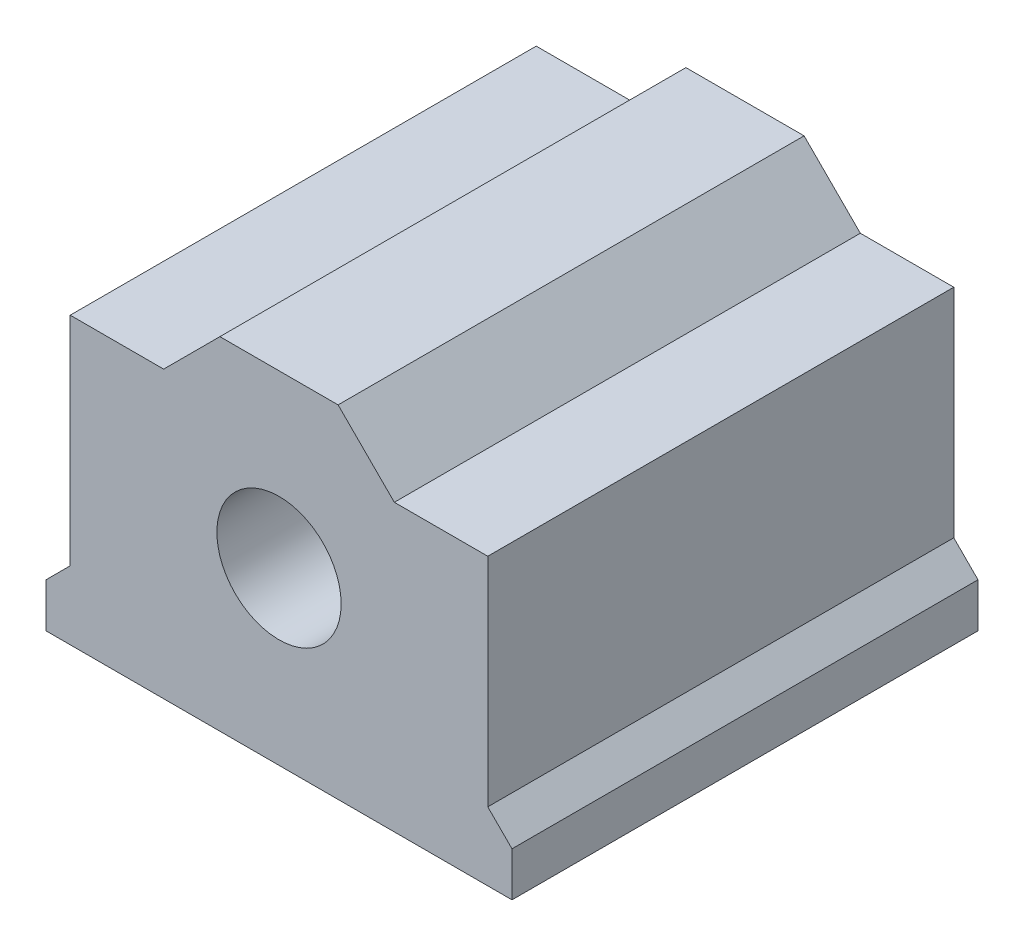
ISO-10303-21;
HEADER;
FILE_DESCRIPTION(('STEP AP214'),'2;1');
FILE_NAME('part.step','',(''),(''),'','','');
FILE_SCHEMA(('AUTOMOTIVE_DESIGN { 1 0 10303 214 1 1 1 1 }'));
ENDSEC;
DATA;
#1=APPLICATION_CONTEXT('core data for automotive mechanical design processes');
#2=APPLICATION_PROTOCOL_DEFINITION('international standard','automotive_design',2000,#1);
#3=PRODUCT_CONTEXT('',#1,'mechanical');
#4=PRODUCT('Part','Part','',(#3));
#5=PRODUCT_RELATED_PRODUCT_CATEGORY('part','',(#4));
#6=PRODUCT_DEFINITION_FORMATION('','',#4);
#7=PRODUCT_DEFINITION_CONTEXT('part definition',#1,'design');
#8=PRODUCT_DEFINITION('design','',#6,#7);
#9=PRODUCT_DEFINITION_SHAPE('','',#8);
#10=(LENGTH_UNIT() NAMED_UNIT(*) SI_UNIT(.MILLI.,.METRE.));
#11=(NAMED_UNIT(*) PLANE_ANGLE_UNIT() SI_UNIT($,.RADIAN.));
#12=(NAMED_UNIT(*) SI_UNIT($,.STERADIAN.) SOLID_ANGLE_UNIT());
#13=UNCERTAINTY_MEASURE_WITH_UNIT(LENGTH_MEASURE(1.E-05),#10,'distance_accuracy_value','');
#14=(GEOMETRIC_REPRESENTATION_CONTEXT(3) GLOBAL_UNCERTAINTY_ASSIGNED_CONTEXT((#13)) GLOBAL_UNIT_ASSIGNED_CONTEXT((#10,
#11,#12)) REPRESENTATION_CONTEXT('',''));
#15=CARTESIAN_POINT('',(0.,0.,0.));
#16=DIRECTION('',(0.,0.,1.));
#17=DIRECTION('',(1.,0.,0.));
#18=AXIS2_PLACEMENT_3D('',#15,#16,#17);
#19=CARTESIAN_POINT('',(0.,22.,0.));
#20=DIRECTION('',(0.,0.,-1.));
#21=DIRECTION('',(-1.,0.,0.));
#22=AXIS2_PLACEMENT_3D('',#19,#20,#21);
#23=PLANE('',#22);
#24=CARTESIAN_POINT('',(15.,11.,0.));
#25=DIRECTION('',(0.,0.,1.));
#26=DIRECTION('',(1.,0.,0.));
#27=AXIS2_PLACEMENT_3D('',#24,#25,#26);
#28=CIRCLE('',#27,4.);
#29=CARTESIAN_POINT('',(19.,11.,0.));
#30=VERTEX_POINT('',#29);
#31=EDGE_CURVE('E262',#30,#30,#28,.T.);
#32=ORIENTED_EDGE('',*,*,#31,.F.);
#33=EDGE_LOOP('',(#32));
#34=FACE_BOUND('',#33,.T.);
#35=DIRECTION('',(-0.707106781186546,0.707106781186549,0.));
#36=VECTOR('',#35,1.);
#37=CARTESIAN_POINT('',(16.4237070287845,16.4237070287845,0.));
#38=LINE('',#37,#36);
#39=CARTESIAN_POINT('',(30.,2.84741405756891,0.));
#40=VERTEX_POINT('',#39);
#41=CARTESIAN_POINT('',(28.4404041781662,4.40700987940275,0.));
#42=VERTEX_POINT('',#41);
#43=EDGE_CURVE('E171',#40,#42,#38,.T.);
#44=ORIENTED_EDGE('',*,*,#43,.T.);
#45=DIRECTION('',(0.,1.,0.));
#46=VECTOR('',#45,1.);
#47=CARTESIAN_POINT('',(28.4404041781662,0.,0.));
#48=LINE('',#47,#46);
#49=CARTESIAN_POINT('',(28.4404041781662,18.3790958150659,0.));
#50=VERTEX_POINT('',#49);
#51=EDGE_CURVE('E185',#42,#50,#48,.T.);
#52=ORIENTED_EDGE('',*,*,#51,.T.);
#53=DIRECTION('',(-1.,0.,0.));
#54=VECTOR('',#53,1.);
#55=CARTESIAN_POINT('',(0.,18.3790958150659,0.));
#56=LINE('',#55,#54);
#57=CARTESIAN_POINT('',(22.4255052227077,18.3790958150659,0.));
#58=VERTEX_POINT('',#57);
#59=EDGE_CURVE('E250',#50,#58,#56,.T.);
#60=ORIENTED_EDGE('',*,*,#59,.T.);
#61=DIRECTION('',(-0.707106781186546,0.707106781186549,0.));
#62=VECTOR('',#61,1.);
#63=CARTESIAN_POINT('',(20.4023005188869,20.4023005188868,0.));
#64=LINE('',#63,#62);
#65=CARTESIAN_POINT('',(18.8046010377736,22.,0.));
#66=VERTEX_POINT('',#65);
#67=EDGE_CURVE('E253',#58,#66,#64,.T.);
#68=ORIENTED_EDGE('',*,*,#67,.T.);
#69=DIRECTION('',(1.,0.,0.));
#70=VECTOR('',#69,1.);
#71=CARTESIAN_POINT('',(0.,22.,0.));
#72=LINE('',#71,#70);
#73=CARTESIAN_POINT('',(11.1953989622264,22.,0.));
#74=VERTEX_POINT('',#73);
#75=EDGE_CURVE('E198',#74,#66,#72,.T.);
#76=ORIENTED_EDGE('',*,*,#75,.F.);
#77=DIRECTION('',(0.707106781186546,0.707106781186549,0.));
#78=VECTOR('',#77,1.);
#79=CARTESIAN_POINT('',(-5.40230051888679,5.40230051888676,0.));
#80=LINE('',#79,#78);
#81=CARTESIAN_POINT('',(7.57449477729228,18.3790958150659,0.));
#82=VERTEX_POINT('',#81);
#83=EDGE_CURVE('E98',#82,#74,#80,.T.);
#84=ORIENTED_EDGE('',*,*,#83,.F.);
#85=DIRECTION('',(1.,0.,0.));
#86=VECTOR('',#85,1.);
#87=CARTESIAN_POINT('',(0.,18.3790958150659,0.));
#88=LINE('',#87,#86);
#89=CARTESIAN_POINT('',(1.55959582183383,18.3790958150659,0.));
#90=VERTEX_POINT('',#89);
#91=EDGE_CURVE('E228',#90,#82,#88,.T.);
#92=ORIENTED_EDGE('',*,*,#91,.F.);
#93=DIRECTION('',(0.,1.,0.));
#94=VECTOR('',#93,1.);
#95=CARTESIAN_POINT('',(1.55959582183383,0.,0.));
#96=LINE('',#95,#94);
#97=CARTESIAN_POINT('',(1.55959582183383,4.40700987940275,0.));
#98=VERTEX_POINT('',#97);
#99=EDGE_CURVE('E220',#98,#90,#96,.T.);
#100=ORIENTED_EDGE('',*,*,#99,.F.);
#101=DIRECTION('',(0.707106781186546,0.707106781186549,0.));
#102=VECTOR('',#101,1.);
#103=CARTESIAN_POINT('',(-1.42370702878446,1.42370702878446,0.));
#104=LINE('',#103,#102);
#105=CARTESIAN_POINT('',(0.,2.84741405756892,0.));
#106=VERTEX_POINT('',#105);
#107=EDGE_CURVE('E224',#106,#98,#104,.T.);
#108=ORIENTED_EDGE('',*,*,#107,.F.);
#109=DIRECTION('',(0.,-1.,0.));
#110=VECTOR('',#109,1.);
#111=CARTESIAN_POINT('',(0.,22.,0.));
#112=LINE('',#111,#110);
#113=CARTESIAN_POINT('',(0.,0.,0.));
#114=VERTEX_POINT('',#113);
#115=EDGE_CURVE('E12',#106,#114,#112,.T.);
#116=ORIENTED_EDGE('',*,*,#115,.T.);
#117=DIRECTION('',(1.,0.,0.));
#118=VECTOR('',#117,1.);
#119=CARTESIAN_POINT('',(0.,0.,0.));
#120=LINE('',#119,#118);
#121=CARTESIAN_POINT('',(30.,0.,0.));
#122=VERTEX_POINT('',#121);
#123=EDGE_CURVE('E200',#114,#122,#120,.T.);
#124=ORIENTED_EDGE('',*,*,#123,.T.);
#125=DIRECTION('',(0.,-1.,0.));
#126=VECTOR('',#125,1.);
#127=CARTESIAN_POINT('',(30.,22.,0.));
#128=LINE('',#127,#126);
#129=EDGE_CURVE('E83',#40,#122,#128,.T.);
#130=ORIENTED_EDGE('',*,*,#129,.F.);
#131=EDGE_LOOP('',(#44,#52,#60,#68,#76,#84,#92,#100,#108,#116,#124,#130));
#132=FACE_BOUND('',#131,.T.);
#133=ADVANCED_FACE('F75',(#34,#132),#23,.F.);
#134=CARTESIAN_POINT('',(30.,22.,0.));
#135=DIRECTION('',(-1.,0.,0.));
#136=DIRECTION('',(0.,0.,1.));
#137=AXIS2_PLACEMENT_3D('',#134,#135,#136);
#138=PLANE('',#137);
#139=DIRECTION('',(0.,0.,1.));
#140=VECTOR('',#139,1.);
#141=CARTESIAN_POINT('',(30.,2.84741405756891,-30.));
#142=LINE('',#141,#140);
#143=CARTESIAN_POINT('',(30.,2.84741405756891,-30.));
#144=VERTEX_POINT('',#143);
#145=EDGE_CURVE('E164',#144,#40,#142,.T.);
#146=ORIENTED_EDGE('',*,*,#145,.T.);
#147=ORIENTED_EDGE('',*,*,#129,.T.);
#148=DIRECTION('',(0.,0.,-1.));
#149=VECTOR('',#148,1.);
#150=CARTESIAN_POINT('',(30.,0.,0.));
#151=LINE('',#150,#149);
#152=CARTESIAN_POINT('',(30.,0.,-30.));
#153=VERTEX_POINT('',#152);
#154=EDGE_CURVE('E189',#122,#153,#151,.T.);
#155=ORIENTED_EDGE('',*,*,#154,.T.);
#156=DIRECTION('',(0.,-1.,0.));
#157=VECTOR('',#156,1.);
#158=CARTESIAN_POINT('',(30.,22.,-30.));
#159=LINE('',#158,#157);
#160=EDGE_CURVE('E182',#144,#153,#159,.T.);
#161=ORIENTED_EDGE('',*,*,#160,.F.);
#162=EDGE_LOOP('',(#146,#147,#155,#161));
#163=FACE_BOUND('',#162,.T.);
#164=ADVANCED_FACE('F187',(#163),#138,.F.);
#165=CARTESIAN_POINT('',(0.,22.,-30.));
#166=DIRECTION('',(0.,0.,1.));
#167=DIRECTION('',(1.,0.,0.));
#168=AXIS2_PLACEMENT_3D('',#165,#166,#167);
#169=PLANE('',#168);
#170=CARTESIAN_POINT('',(15.,11.,-30.));
#171=DIRECTION('',(0.,0.,1.));
#172=DIRECTION('',(1.,0.,0.));
#173=AXIS2_PLACEMENT_3D('',#170,#171,#172);
#174=CIRCLE('',#173,4.);
#175=CARTESIAN_POINT('',(19.,11.,-30.));
#176=VERTEX_POINT('',#175);
#177=EDGE_CURVE('E257',#176,#176,#174,.T.);
#178=ORIENTED_EDGE('',*,*,#177,.T.);
#179=EDGE_LOOP('',(#178));
#180=FACE_BOUND('',#179,.T.);
#181=DIRECTION('',(-0.707106781186546,0.707106781186549,0.));
#182=VECTOR('',#181,1.);
#183=CARTESIAN_POINT('',(16.4237070287845,16.4237070287845,-30.));
#184=LINE('',#183,#182);
#185=CARTESIAN_POINT('',(28.4404041781662,4.40700987940275,-30.));
#186=VERTEX_POINT('',#185);
#187=EDGE_CURVE('E168',#144,#186,#184,.T.);
#188=ORIENTED_EDGE('',*,*,#187,.F.);
#189=ORIENTED_EDGE('',*,*,#160,.T.);
#190=DIRECTION('',(-1.,0.,0.));
#191=VECTOR('',#190,1.);
#192=CARTESIAN_POINT('',(0.,0.,-30.));
#193=LINE('',#192,#191);
#194=CARTESIAN_POINT('',(0.,0.,-30.));
#195=VERTEX_POINT('',#194);
#196=EDGE_CURVE('E196',#153,#195,#193,.T.);
#197=ORIENTED_EDGE('',*,*,#196,.T.);
#198=DIRECTION('',(0.,-1.,0.));
#199=VECTOR('',#198,1.);
#200=CARTESIAN_POINT('',(0.,22.,-30.));
#201=LINE('',#200,#199);
#202=CARTESIAN_POINT('',(0.,2.84741405756892,-30.));
#203=VERTEX_POINT('',#202);
#204=EDGE_CURVE('E191',#203,#195,#201,.T.);
#205=ORIENTED_EDGE('',*,*,#204,.F.);
#206=DIRECTION('',(0.707106781186546,0.707106781186549,0.));
#207=VECTOR('',#206,1.);
#208=CARTESIAN_POINT('',(-1.42370702878446,1.42370702878446,-30.));
#209=LINE('',#208,#207);
#210=CARTESIAN_POINT('',(1.55959582183383,4.40700987940275,-30.));
#211=VERTEX_POINT('',#210);
#212=EDGE_CURVE('E234',#203,#211,#209,.T.);
#213=ORIENTED_EDGE('',*,*,#212,.T.);
#214=DIRECTION('',(0.,1.,0.));
#215=VECTOR('',#214,1.);
#216=CARTESIAN_POINT('',(1.55959582183383,0.,-30.));
#217=LINE('',#216,#215);
#218=CARTESIAN_POINT('',(1.55959582183383,18.3790958150659,-30.));
#219=VERTEX_POINT('',#218);
#220=EDGE_CURVE('E213',#211,#219,#217,.T.);
#221=ORIENTED_EDGE('',*,*,#220,.T.);
#222=DIRECTION('',(1.,0.,0.));
#223=VECTOR('',#222,1.);
#224=CARTESIAN_POINT('',(0.,18.3790958150659,-30.));
#225=LINE('',#224,#223);
#226=CARTESIAN_POINT('',(7.57449477729228,18.3790958150659,-30.));
#227=VERTEX_POINT('',#226);
#228=EDGE_CURVE('E223',#219,#227,#225,.T.);
#229=ORIENTED_EDGE('',*,*,#228,.T.);
#230=DIRECTION('',(0.707106781186546,0.707106781186549,0.));
#231=VECTOR('',#230,1.);
#232=CARTESIAN_POINT('',(-5.40230051888679,5.40230051888676,-30.));
#233=LINE('',#232,#231);
#234=CARTESIAN_POINT('',(11.1953989622264,22.,-30.));
#235=VERTEX_POINT('',#234);
#236=EDGE_CURVE('E237',#227,#235,#233,.T.);
#237=ORIENTED_EDGE('',*,*,#236,.T.);
#238=DIRECTION('',(-1.,0.,0.));
#239=VECTOR('',#238,1.);
#240=CARTESIAN_POINT('',(0.,22.,-30.));
#241=LINE('',#240,#239);
#242=CARTESIAN_POINT('',(18.8046010377736,22.,-30.));
#243=VERTEX_POINT('',#242);
#244=EDGE_CURVE('E193',#243,#235,#241,.T.);
#245=ORIENTED_EDGE('',*,*,#244,.F.);
#246=DIRECTION('',(-0.707106781186546,0.707106781186549,0.));
#247=VECTOR('',#246,1.);
#248=CARTESIAN_POINT('',(20.4023005188869,20.4023005188868,-30.));
#249=LINE('',#248,#247);
#250=CARTESIAN_POINT('',(22.4255052227077,18.3790958150659,-30.));
#251=VERTEX_POINT('',#250);
#252=EDGE_CURVE('E90',#251,#243,#249,.T.);
#253=ORIENTED_EDGE('',*,*,#252,.F.);
#254=DIRECTION('',(-1.,0.,0.));
#255=VECTOR('',#254,1.);
#256=CARTESIAN_POINT('',(0.,18.3790958150659,-30.));
#257=LINE('',#256,#255);
#258=CARTESIAN_POINT('',(28.4404041781662,18.3790958150659,-30.));
#259=VERTEX_POINT('',#258);
#260=EDGE_CURVE('E259',#259,#251,#257,.T.);
#261=ORIENTED_EDGE('',*,*,#260,.F.);
#262=DIRECTION('',(0.,1.,0.));
#263=VECTOR('',#262,1.);
#264=CARTESIAN_POINT('',(28.4404041781662,0.,-30.));
#265=LINE('',#264,#263);
#266=EDGE_CURVE('E176',#186,#259,#265,.T.);
#267=ORIENTED_EDGE('',*,*,#266,.F.);
#268=EDGE_LOOP('',(#188,#189,#197,#205,#213,#221,#229,#237,#245,#253,#261,#267));
#269=FACE_BOUND('',#268,.T.);
#270=ADVANCED_FACE('F180',(#180,#269),#169,.F.);
#271=CARTESIAN_POINT('',(0.,22.,0.));
#272=DIRECTION('',(0.,-1.,0.));
#273=DIRECTION('',(0.,0.,-1.));
#274=AXIS2_PLACEMENT_3D('',#271,#272,#273);
#275=PLANE('',#274);
#276=DIRECTION('',(0.,0.,1.));
#277=VECTOR('',#276,1.);
#278=CARTESIAN_POINT('',(18.8046010377736,22.,-30.));
#279=LINE('',#278,#277);
#280=EDGE_CURVE('E175',#243,#66,#279,.T.);
#281=ORIENTED_EDGE('',*,*,#280,.F.);
#282=ORIENTED_EDGE('',*,*,#244,.T.);
#283=DIRECTION('',(0.,0.,1.));
#284=VECTOR('',#283,1.);
#285=CARTESIAN_POINT('',(11.1953989622264,22.,-30.));
#286=LINE('',#285,#284);
#287=EDGE_CURVE('E212',#235,#74,#286,.T.);
#288=ORIENTED_EDGE('',*,*,#287,.T.);
#289=ORIENTED_EDGE('',*,*,#75,.T.);
#290=EDGE_LOOP('',(#281,#282,#288,#289));
#291=FACE_BOUND('',#290,.T.);
#292=ADVANCED_FACE('F302',(#291),#275,.F.);
#293=CARTESIAN_POINT('',(0.,22.,0.));
#294=DIRECTION('',(1.,0.,0.));
#295=DIRECTION('',(0.,0.,-1.));
#296=AXIS2_PLACEMENT_3D('',#293,#294,#295);
#297=PLANE('',#296);
#298=ORIENTED_EDGE('',*,*,#115,.F.);
#299=DIRECTION('',(0.,0.,1.));
#300=VECTOR('',#299,1.);
#301=CARTESIAN_POINT('',(0.,2.84741405756892,-30.));
#302=LINE('',#301,#300);
#303=EDGE_CURVE('E215',#203,#106,#302,.T.);
#304=ORIENTED_EDGE('',*,*,#303,.F.);
#305=ORIENTED_EDGE('',*,*,#204,.T.);
#306=DIRECTION('',(0.,0.,1.));
#307=VECTOR('',#306,1.);
#308=CARTESIAN_POINT('',(0.,0.,0.));
#309=LINE('',#308,#307);
#310=EDGE_CURVE('E203',#195,#114,#309,.T.);
#311=ORIENTED_EDGE('',*,*,#310,.T.);
#312=EDGE_LOOP('',(#298,#304,#305,#311));
#313=FACE_BOUND('',#312,.T.);
#314=ADVANCED_FACE('F77',(#313),#297,.F.);
#315=CARTESIAN_POINT('',(0.,0.,0.));
#316=DIRECTION('',(0.,-1.,0.));
#317=DIRECTION('',(0.,0.,-1.));
#318=AXIS2_PLACEMENT_3D('',#315,#316,#317);
#319=PLANE('',#318);
#320=ORIENTED_EDGE('',*,*,#310,.F.);
#321=ORIENTED_EDGE('',*,*,#196,.F.);
#322=ORIENTED_EDGE('',*,*,#154,.F.);
#323=ORIENTED_EDGE('',*,*,#123,.F.);
#324=EDGE_LOOP('',(#320,#321,#322,#323));
#325=FACE_BOUND('',#324,.T.);
#326=ADVANCED_FACE('F283',(#325),#319,.T.);
#327=CARTESIAN_POINT('',(0.,18.3790958150659,-30.));
#328=DIRECTION('',(0.,-1.,0.));
#329=DIRECTION('',(0.,0.,-1.));
#330=AXIS2_PLACEMENT_3D('',#327,#328,#329);
#331=PLANE('',#330);
#332=ORIENTED_EDGE('',*,*,#91,.T.);
#333=DIRECTION('',(0.,0.,1.));
#334=VECTOR('',#333,1.);
#335=CARTESIAN_POINT('',(7.57449477729228,18.3790958150659,-30.));
#336=LINE('',#335,#334);
#337=EDGE_CURVE('E210',#227,#82,#336,.T.);
#338=ORIENTED_EDGE('',*,*,#337,.F.);
#339=ORIENTED_EDGE('',*,*,#228,.F.);
#340=DIRECTION('',(0.,0.,1.));
#341=VECTOR('',#340,1.);
#342=CARTESIAN_POINT('',(1.55959582183383,18.3790958150659,-30.));
#343=LINE('',#342,#341);
#344=EDGE_CURVE('E206',#219,#90,#343,.T.);
#345=ORIENTED_EDGE('',*,*,#344,.T.);
#346=EDGE_LOOP('',(#332,#338,#339,#345));
#347=FACE_BOUND('',#346,.T.);
#348=ADVANCED_FACE('F298',(#347),#331,.F.);
#349=CARTESIAN_POINT('',(1.55959582183383,0.,-30.));
#350=DIRECTION('',(1.,0.,0.));
#351=DIRECTION('',(0.,0.,-1.));
#352=AXIS2_PLACEMENT_3D('',#349,#350,#351);
#353=PLANE('',#352);
#354=ORIENTED_EDGE('',*,*,#99,.T.);
#355=ORIENTED_EDGE('',*,*,#344,.F.);
#356=ORIENTED_EDGE('',*,*,#220,.F.);
#357=DIRECTION('',(0.,0.,1.));
#358=VECTOR('',#357,1.);
#359=CARTESIAN_POINT('',(1.55959582183383,4.40700987940275,-30.));
#360=LINE('',#359,#358);
#361=EDGE_CURVE('E217',#211,#98,#360,.T.);
#362=ORIENTED_EDGE('',*,*,#361,.T.);
#363=EDGE_LOOP('',(#354,#355,#356,#362));
#364=FACE_BOUND('',#363,.T.);
#365=ADVANCED_FACE('F292',(#364),#353,.F.);
#366=CARTESIAN_POINT('',(-1.42370702878446,1.42370702878446,-30.));
#367=DIRECTION('',(0.707106781186549,-0.707106781186546,0.));
#368=DIRECTION('',(0.707106781186546,0.707106781186549,0.));
#369=AXIS2_PLACEMENT_3D('',#366,#367,#368);
#370=PLANE('',#369);
#371=ORIENTED_EDGE('',*,*,#107,.T.);
#372=ORIENTED_EDGE('',*,*,#361,.F.);
#373=ORIENTED_EDGE('',*,*,#212,.F.);
#374=ORIENTED_EDGE('',*,*,#303,.T.);
#375=EDGE_LOOP('',(#371,#372,#373,#374));
#376=FACE_BOUND('',#375,.T.);
#377=ADVANCED_FACE('F288',(#376),#370,.F.);
#378=CARTESIAN_POINT('',(-5.40230051888679,5.40230051888676,-30.));
#379=DIRECTION('',(0.707106781186549,-0.707106781186546,0.));
#380=DIRECTION('',(0.707106781186546,0.707106781186549,0.));
#381=AXIS2_PLACEMENT_3D('',#378,#379,#380);
#382=PLANE('',#381);
#383=ORIENTED_EDGE('',*,*,#83,.T.);
#384=ORIENTED_EDGE('',*,*,#287,.F.);
#385=ORIENTED_EDGE('',*,*,#236,.F.);
#386=ORIENTED_EDGE('',*,*,#337,.T.);
#387=EDGE_LOOP('',(#383,#384,#385,#386));
#388=FACE_BOUND('',#387,.T.);
#389=ADVANCED_FACE('F299',(#388),#382,.F.);
#390=CARTESIAN_POINT('',(16.4237070287845,16.4237070287845,-30.));
#391=DIRECTION('',(0.707106781186549,0.707106781186546,0.));
#392=DIRECTION('',(-0.707106781186546,0.707106781186549,0.));
#393=AXIS2_PLACEMENT_3D('',#390,#391,#392);
#394=PLANE('',#393);
#395=ORIENTED_EDGE('',*,*,#43,.F.);
#396=ORIENTED_EDGE('',*,*,#145,.F.);
#397=ORIENTED_EDGE('',*,*,#187,.T.);
#398=DIRECTION('',(0.,0.,1.));
#399=VECTOR('',#398,1.);
#400=CARTESIAN_POINT('',(28.4404041781662,4.40700987940275,-30.));
#401=LINE('',#400,#399);
#402=EDGE_CURVE('E231',#186,#42,#401,.T.);
#403=ORIENTED_EDGE('',*,*,#402,.T.);
#404=EDGE_LOOP('',(#395,#396,#397,#403));
#405=FACE_BOUND('',#404,.T.);
#406=ADVANCED_FACE('F166',(#405),#394,.T.);
#407=CARTESIAN_POINT('',(28.4404041781662,0.,-30.));
#408=DIRECTION('',(1.,0.,0.));
#409=DIRECTION('',(0.,0.,-1.));
#410=AXIS2_PLACEMENT_3D('',#407,#408,#409);
#411=PLANE('',#410);
#412=ORIENTED_EDGE('',*,*,#51,.F.);
#413=ORIENTED_EDGE('',*,*,#402,.F.);
#414=ORIENTED_EDGE('',*,*,#266,.T.);
#415=DIRECTION('',(0.,0.,1.));
#416=VECTOR('',#415,1.);
#417=CARTESIAN_POINT('',(28.4404041781662,18.3790958150659,-30.));
#418=LINE('',#417,#416);
#419=EDGE_CURVE('E245',#259,#50,#418,.T.);
#420=ORIENTED_EDGE('',*,*,#419,.T.);
#421=EDGE_LOOP('',(#412,#413,#414,#420));
#422=FACE_BOUND('',#421,.T.);
#423=ADVANCED_FACE('F309',(#422),#411,.T.);
#424=CARTESIAN_POINT('',(0.,18.3790958150659,-30.));
#425=DIRECTION('',(0.,1.,0.));
#426=DIRECTION('',(0.,0.,1.));
#427=AXIS2_PLACEMENT_3D('',#424,#425,#426);
#428=PLANE('',#427);
#429=ORIENTED_EDGE('',*,*,#59,.F.);
#430=ORIENTED_EDGE('',*,*,#419,.F.);
#431=ORIENTED_EDGE('',*,*,#260,.T.);
#432=DIRECTION('',(0.,0.,1.));
#433=VECTOR('',#432,1.);
#434=CARTESIAN_POINT('',(22.4255052227077,18.3790958150659,-30.));
#435=LINE('',#434,#433);
#436=EDGE_CURVE('E243',#251,#58,#435,.T.);
#437=ORIENTED_EDGE('',*,*,#436,.T.);
#438=EDGE_LOOP('',(#429,#430,#431,#437));
#439=FACE_BOUND('',#438,.T.);
#440=ADVANCED_FACE('F307',(#439),#428,.T.);
#441=CARTESIAN_POINT('',(20.4023005188869,20.4023005188868,-30.));
#442=DIRECTION('',(0.707106781186549,0.707106781186546,0.));
#443=DIRECTION('',(-0.707106781186546,0.707106781186549,0.));
#444=AXIS2_PLACEMENT_3D('',#441,#442,#443);
#445=PLANE('',#444);
#446=ORIENTED_EDGE('',*,*,#67,.F.);
#447=ORIENTED_EDGE('',*,*,#436,.F.);
#448=ORIENTED_EDGE('',*,*,#252,.T.);
#449=ORIENTED_EDGE('',*,*,#280,.T.);
#450=EDGE_LOOP('',(#446,#447,#448,#449));
#451=FACE_BOUND('',#450,.T.);
#452=ADVANCED_FACE('F272',(#451),#445,.T.);
#453=CARTESIAN_POINT('',(15.,11.,-30.));
#454=DIRECTION('',(0.,0.,1.));
#455=DIRECTION('',(1.,0.,0.));
#456=AXIS2_PLACEMENT_3D('',#453,#454,#455);
#457=CYLINDRICAL_SURFACE('',#456,4.);
#458=ORIENTED_EDGE('',*,*,#177,.F.);
#459=EDGE_LOOP('',(#458));
#460=FACE_BOUND('',#459,.T.);
#461=ORIENTED_EDGE('',*,*,#31,.T.);
#462=EDGE_LOOP('',(#461));
#463=FACE_BOUND('',#462,.T.);
#464=ADVANCED_FACE('F269',(#460,#463),#457,.F.);
#465=CLOSED_SHELL('',(#133,#164,#270,#292,#314,#326,#348,#365,#377,#389,#406,#423,#440,#452,#464));
#466=MANIFOLD_SOLID_BREP('B2',#465);
#467=ADVANCED_BREP_SHAPE_REPRESENTATION('',(#18,#466),#14);
#468=SHAPE_DEFINITION_REPRESENTATION(#9,#467);
ENDSEC;
END-ISO-10303-21;
